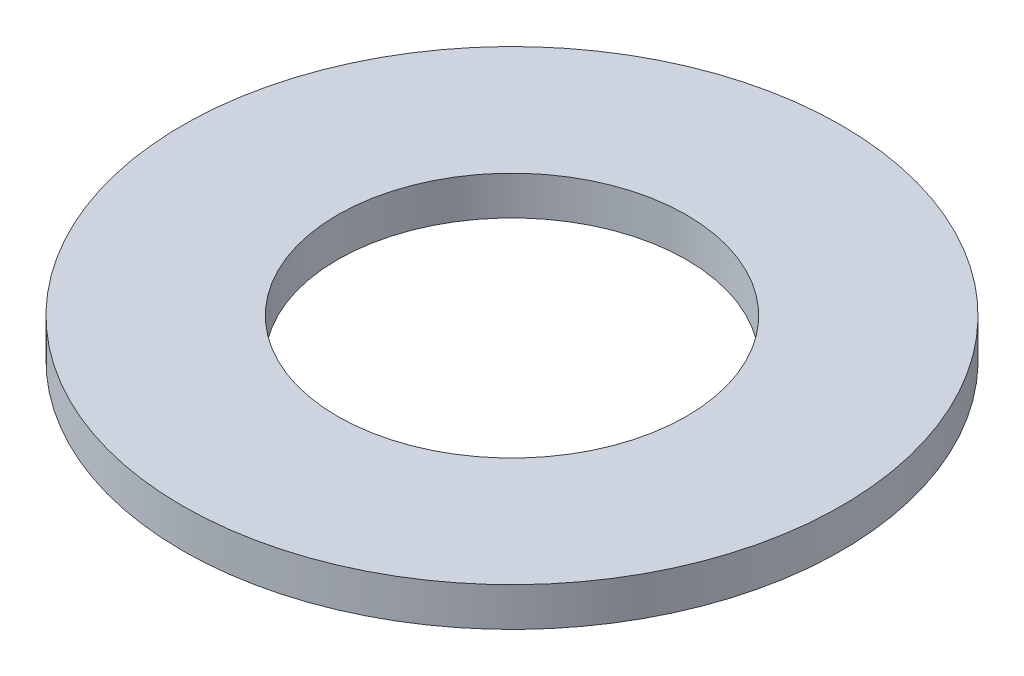
ISO-10303-21;
HEADER;
FILE_DESCRIPTION(('STEP AP214'),'2;1');
FILE_NAME('part.step','',(''),(''),'','','');
FILE_SCHEMA(('AUTOMOTIVE_DESIGN { 1 0 10303 214 1 1 1 1 }'));
ENDSEC;
DATA;
#1=APPLICATION_CONTEXT('core data for automotive mechanical design processes');
#2=APPLICATION_PROTOCOL_DEFINITION('international standard','automotive_design',2000,#1);
#3=PRODUCT_CONTEXT('',#1,'mechanical');
#4=PRODUCT('Part','Part','',(#3));
#5=PRODUCT_RELATED_PRODUCT_CATEGORY('part','',(#4));
#6=PRODUCT_DEFINITION_FORMATION('','',#4);
#7=PRODUCT_DEFINITION_CONTEXT('part definition',#1,'design');
#8=PRODUCT_DEFINITION('design','',#6,#7);
#9=PRODUCT_DEFINITION_SHAPE('','',#8);
#10=(LENGTH_UNIT() NAMED_UNIT(*) SI_UNIT(.MILLI.,.METRE.));
#11=(NAMED_UNIT(*) PLANE_ANGLE_UNIT() SI_UNIT($,.RADIAN.));
#12=(NAMED_UNIT(*) SI_UNIT($,.STERADIAN.) SOLID_ANGLE_UNIT());
#13=UNCERTAINTY_MEASURE_WITH_UNIT(LENGTH_MEASURE(1.E-05),#10,'distance_accuracy_value','');
#14=(GEOMETRIC_REPRESENTATION_CONTEXT(3) GLOBAL_UNCERTAINTY_ASSIGNED_CONTEXT((#13)) GLOBAL_UNIT_ASSIGNED_CONTEXT((#10,
#11,#12)) REPRESENTATION_CONTEXT('',''));
#15=CARTESIAN_POINT('',(0.,0.,0.));
#16=DIRECTION('',(0.,0.,1.));
#17=DIRECTION('',(1.,0.,0.));
#18=AXIS2_PLACEMENT_3D('',#15,#16,#17);
#19=CARTESIAN_POINT('',(0.,10.,0.));
#20=DIRECTION('',(0.,-1.,0.));
#21=DIRECTION('',(0.,0.,-1.));
#22=AXIS2_PLACEMENT_3D('',#19,#20,#21);
#23=CYLINDRICAL_SURFACE('',#22,85.);
#24=CARTESIAN_POINT('',(0.,10.,0.));
#25=DIRECTION('',(0.,1.,0.));
#26=DIRECTION('',(0.,0.,1.));
#27=AXIS2_PLACEMENT_3D('',#24,#25,#26);
#28=CIRCLE('',#27,85.);
#29=CARTESIAN_POINT('',(0.,10.,85.));
#30=VERTEX_POINT('',#29);
#31=EDGE_CURVE('E10',#30,#30,#28,.T.);
#32=ORIENTED_EDGE('',*,*,#31,.F.);
#33=EDGE_LOOP('',(#32));
#34=FACE_BOUND('',#33,.T.);
#35=CARTESIAN_POINT('',(0.,0.,0.));
#36=DIRECTION('',(0.,1.,0.));
#37=DIRECTION('',(0.,0.,1.));
#38=AXIS2_PLACEMENT_3D('',#35,#36,#37);
#39=CIRCLE('',#38,85.);
#40=CARTESIAN_POINT('',(0.,0.,85.));
#41=VERTEX_POINT('',#40);
#42=EDGE_CURVE('E37',#41,#41,#39,.T.);
#43=ORIENTED_EDGE('',*,*,#42,.T.);
#44=EDGE_LOOP('',(#43));
#45=FACE_BOUND('',#44,.T.);
#46=ADVANCED_FACE('F40',(#34,#45),#23,.T.);
#47=CARTESIAN_POINT('',(0.,10.,0.));
#48=DIRECTION('',(0.,1.,0.));
#49=DIRECTION('',(0.,0.,1.));
#50=AXIS2_PLACEMENT_3D('',#47,#48,#49);
#51=PLANE('',#50);
#52=CARTESIAN_POINT('',(0.,10.,0.));
#53=DIRECTION('',(0.,1.,0.));
#54=DIRECTION('',(0.,0.,1.));
#55=AXIS2_PLACEMENT_3D('',#52,#53,#54);
#56=CIRCLE('',#55,45.);
#57=CARTESIAN_POINT('',(0.,10.,45.));
#58=VERTEX_POINT('',#57);
#59=EDGE_CURVE('E50',#58,#58,#56,.T.);
#60=ORIENTED_EDGE('',*,*,#59,.F.);
#61=EDGE_LOOP('',(#60));
#62=FACE_BOUND('',#61,.T.);
#63=ORIENTED_EDGE('',*,*,#31,.T.);
#64=EDGE_LOOP('',(#63));
#65=FACE_BOUND('',#64,.T.);
#66=ADVANCED_FACE('F59',(#62,#65),#51,.T.);
#67=CARTESIAN_POINT('',(0.,0.,0.));
#68=DIRECTION('',(0.,1.,0.));
#69=DIRECTION('',(0.,0.,1.));
#70=AXIS2_PLACEMENT_3D('',#67,#68,#69);
#71=PLANE('',#70);
#72=CARTESIAN_POINT('',(0.,0.,0.));
#73=DIRECTION('',(0.,1.,0.));
#74=DIRECTION('',(0.,0.,1.));
#75=AXIS2_PLACEMENT_3D('',#72,#73,#74);
#76=CIRCLE('',#75,45.);
#77=CARTESIAN_POINT('',(0.,0.,45.));
#78=VERTEX_POINT('',#77);
#79=EDGE_CURVE('E47',#78,#78,#76,.T.);
#80=ORIENTED_EDGE('',*,*,#79,.T.);
#81=EDGE_LOOP('',(#80));
#82=FACE_BOUND('',#81,.T.);
#83=ORIENTED_EDGE('',*,*,#42,.F.);
#84=EDGE_LOOP('',(#83));
#85=FACE_BOUND('',#84,.T.);
#86=ADVANCED_FACE('F58',(#82,#85),#71,.F.);
#87=CARTESIAN_POINT('',(0.,10.,0.));
#88=DIRECTION('',(0.,-1.,0.));
#89=DIRECTION('',(0.,0.,-1.));
#90=AXIS2_PLACEMENT_3D('',#87,#88,#89);
#91=CYLINDRICAL_SURFACE('',#90,45.);
#92=ORIENTED_EDGE('',*,*,#59,.T.);
#93=EDGE_LOOP('',(#92));
#94=FACE_BOUND('',#93,.T.);
#95=ORIENTED_EDGE('',*,*,#79,.F.);
#96=EDGE_LOOP('',(#95));
#97=FACE_BOUND('',#96,.T.);
#98=ADVANCED_FACE('F54',(#94,#97),#91,.F.);
#99=CLOSED_SHELL('',(#46,#66,#86,#98));
#100=MANIFOLD_SOLID_BREP('B2',#99);
#101=ADVANCED_BREP_SHAPE_REPRESENTATION('',(#18,#100),#14);
#102=SHAPE_DEFINITION_REPRESENTATION(#9,#101);
ENDSEC;
END-ISO-10303-21;
